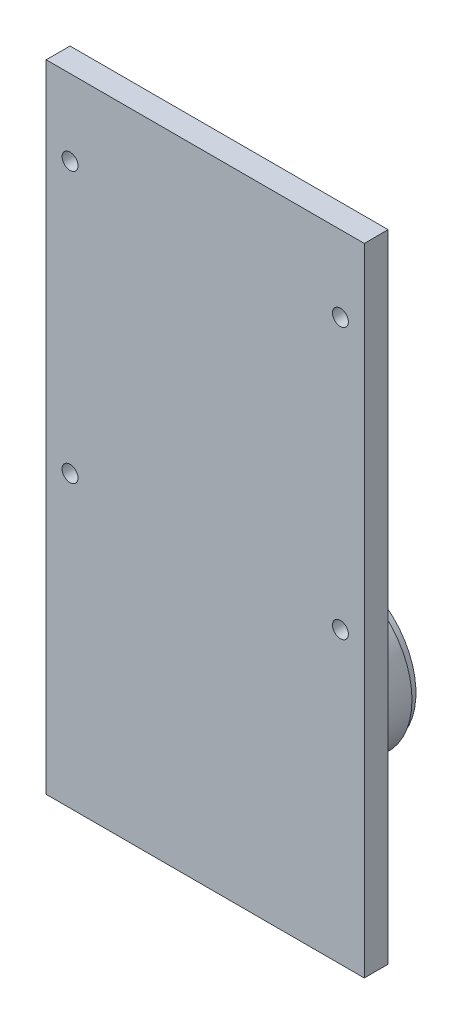
ISO-10303-21;
HEADER;
FILE_DESCRIPTION(('STEP AP214'),'2;1');
FILE_NAME('part.step','',(''),(''),'','','');
FILE_SCHEMA(('AUTOMOTIVE_DESIGN { 1 0 10303 214 1 1 1 1 }'));
ENDSEC;
DATA;
#1=APPLICATION_CONTEXT('core data for automotive mechanical design processes');
#2=APPLICATION_PROTOCOL_DEFINITION('international standard','automotive_design',2000,#1);
#3=PRODUCT_CONTEXT('',#1,'mechanical');
#4=PRODUCT('Part','Part','',(#3));
#5=PRODUCT_RELATED_PRODUCT_CATEGORY('part','',(#4));
#6=PRODUCT_DEFINITION_FORMATION('','',#4);
#7=PRODUCT_DEFINITION_CONTEXT('part definition',#1,'design');
#8=PRODUCT_DEFINITION('design','',#6,#7);
#9=PRODUCT_DEFINITION_SHAPE('','',#8);
#10=(LENGTH_UNIT() NAMED_UNIT(*) SI_UNIT(.MILLI.,.METRE.));
#11=(NAMED_UNIT(*) PLANE_ANGLE_UNIT() SI_UNIT($,.RADIAN.));
#12=(NAMED_UNIT(*) SI_UNIT($,.STERADIAN.) SOLID_ANGLE_UNIT());
#13=UNCERTAINTY_MEASURE_WITH_UNIT(LENGTH_MEASURE(1.E-05),#10,'distance_accuracy_value','');
#14=(GEOMETRIC_REPRESENTATION_CONTEXT(3) GLOBAL_UNCERTAINTY_ASSIGNED_CONTEXT((#13)) GLOBAL_UNIT_ASSIGNED_CONTEXT((#10,
#11,#12)) REPRESENTATION_CONTEXT('',''));
#15=CARTESIAN_POINT('',(0.,0.,0.));
#16=DIRECTION('',(0.,0.,1.));
#17=DIRECTION('',(1.,0.,0.));
#18=AXIS2_PLACEMENT_3D('',#15,#16,#17);
#19=CARTESIAN_POINT('',(20.,17.3034898736371,-13.));
#20=DIRECTION('',(0.,0.,-1.));
#21=DIRECTION('',(-1.,0.,0.));
#22=AXIS2_PLACEMENT_3D('',#19,#20,#21);
#23=PLANE('',#22);
#24=CARTESIAN_POINT('',(20.,17.3034898736371,-13.));
#25=DIRECTION('',(0.,0.,-1.));
#26=DIRECTION('',(-1.,0.,0.));
#27=AXIS2_PLACEMENT_3D('',#24,#25,#26);
#28=CIRCLE('',#27,7.5);
#29=CARTESIAN_POINT('',(12.5,17.3034898736371,-13.));
#30=VERTEX_POINT('',#29);
#31=EDGE_CURVE('E291',#30,#30,#28,.T.);
#32=ORIENTED_EDGE('',*,*,#31,.T.);
#33=EDGE_LOOP('',(#32));
#34=FACE_BOUND('',#33,.T.);
#35=CARTESIAN_POINT('',(20.,17.3034898736371,-13.));
#36=DIRECTION('',(0.,0.,-1.));
#37=DIRECTION('',(-1.,0.,0.));
#38=AXIS2_PLACEMENT_3D('',#35,#36,#37);
#39=CIRCLE('',#38,8.53357649545198);
#40=CARTESIAN_POINT('',(11.466423504548,17.3034898736371,-13.));
#41=VERTEX_POINT('',#40);
#42=EDGE_CURVE('E49',#41,#41,#39,.F.);
#43=ORIENTED_EDGE('',*,*,#42,.T.);
#44=EDGE_LOOP('',(#43));
#45=FACE_BOUND('',#44,.T.);
#46=ADVANCED_FACE('F45',(#34,#45),#23,.F.);
#47=CARTESIAN_POINT('',(20.,17.3034898736371,-13.));
#48=DIRECTION('',(0.,1.,0.));
#49=DIRECTION('',(-1.,0.,0.));
#50=AXIS2_PLACEMENT_3D('',#47,#48,#49);
#51=SPHERICAL_SURFACE('',#50,8.53357649545198);
#52=CARTESIAN_POINT('',(20.,17.3034898736371,-13.));
#53=DIRECTION('',(0.,0.,-1.));
#54=DIRECTION('',(-1.,0.,0.));
#55=AXIS2_PLACEMENT_3D('',#52,#53,#54);
#56=SPHERICAL_SURFACE('',#55,8.53357649545198);
#57=ORIENTED_EDGE('',*,*,#42,.F.);
#58=EDGE_LOOP('',(#57));
#59=FACE_BOUND('',#58,.T.);
#60=ADVANCED_FACE('F220',(#59),#56,.F.);
#61=CARTESIAN_POINT('',(20.,17.3034898736371,-13.));
#62=DIRECTION('',(0.,0.,-1.));
#63=DIRECTION('',(-1.,0.,0.));
#64=AXIS2_PLACEMENT_3D('',#61,#62,#63);
#65=CYLINDRICAL_SURFACE('',#64,7.5);
#66=ORIENTED_EDGE('',*,*,#31,.F.);
#67=EDGE_LOOP('',(#66));
#68=FACE_BOUND('',#67,.T.);
#69=CARTESIAN_POINT('',(20.,17.3034898736371,-14.));
#70=DIRECTION('',(0.,0.,-1.));
#71=DIRECTION('',(-1.,0.,0.));
#72=AXIS2_PLACEMENT_3D('',#69,#70,#71);
#73=CIRCLE('',#72,7.5);
#74=CARTESIAN_POINT('',(12.5,17.3034898736371,-14.));
#75=VERTEX_POINT('',#74);
#76=EDGE_CURVE('E294',#75,#75,#73,.T.);
#77=ORIENTED_EDGE('',*,*,#76,.T.);
#78=EDGE_LOOP('',(#77));
#79=FACE_BOUND('',#78,.T.);
#80=ADVANCED_FACE('F226',(#68,#79),#65,.F.);
#81=CARTESIAN_POINT('',(0.,0.,3.));
#82=DIRECTION('',(1.,0.,0.));
#83=DIRECTION('',(0.,0.,-1.));
#84=AXIS2_PLACEMENT_3D('',#81,#82,#83);
#85=PLANE('',#84);
#86=DIRECTION('',(0.,-1.,0.));
#87=VECTOR('',#86,1.);
#88=CARTESIAN_POINT('',(0.,0.,0.));
#89=LINE('',#88,#87);
#90=CARTESIAN_POINT('',(0.,80.,0.));
#91=VERTEX_POINT('',#90);
#92=CARTESIAN_POINT('',(0.,0.,0.));
#93=VERTEX_POINT('',#92);
#94=EDGE_CURVE('E120',#91,#93,#89,.T.);
#95=ORIENTED_EDGE('',*,*,#94,.T.);
#96=DIRECTION('',(0.,0.,-1.));
#97=VECTOR('',#96,1.);
#98=CARTESIAN_POINT('',(0.,0.,3.));
#99=LINE('',#98,#97);
#100=CARTESIAN_POINT('',(0.,0.,3.));
#101=VERTEX_POINT('',#100);
#102=EDGE_CURVE('E109',#101,#93,#99,.T.);
#103=ORIENTED_EDGE('',*,*,#102,.F.);
#104=DIRECTION('',(0.,-1.,0.));
#105=VECTOR('',#104,1.);
#106=CARTESIAN_POINT('',(0.,0.,3.));
#107=LINE('',#106,#105);
#108=CARTESIAN_POINT('',(0.,80.,3.));
#109=VERTEX_POINT('',#108);
#110=EDGE_CURVE('E101',#109,#101,#107,.T.);
#111=ORIENTED_EDGE('',*,*,#110,.F.);
#112=DIRECTION('',(0.,0.,-1.));
#113=VECTOR('',#112,1.);
#114=CARTESIAN_POINT('',(0.,80.,3.));
#115=LINE('',#114,#113);
#116=EDGE_CURVE('E116',#109,#91,#115,.T.);
#117=ORIENTED_EDGE('',*,*,#116,.T.);
#118=EDGE_LOOP('',(#95,#103,#111,#117));
#119=FACE_BOUND('',#118,.T.);
#120=ADVANCED_FACE('F279',(#119),#85,.F.);
#121=CARTESIAN_POINT('',(0.,0.,3.));
#122=DIRECTION('',(0.,1.,0.));
#123=DIRECTION('',(0.,0.,1.));
#124=AXIS2_PLACEMENT_3D('',#121,#122,#123);
#125=PLANE('',#124);
#126=DIRECTION('',(1.,0.,0.));
#127=VECTOR('',#126,1.);
#128=CARTESIAN_POINT('',(0.,0.,0.));
#129=LINE('',#128,#127);
#130=CARTESIAN_POINT('',(40.,0.,0.));
#131=VERTEX_POINT('',#130);
#132=EDGE_CURVE('E107',#93,#131,#129,.T.);
#133=ORIENTED_EDGE('',*,*,#132,.T.);
#134=DIRECTION('',(0.,0.,-1.));
#135=VECTOR('',#134,1.);
#136=CARTESIAN_POINT('',(40.,0.,3.));
#137=LINE('',#136,#135);
#138=CARTESIAN_POINT('',(40.,0.,3.));
#139=VERTEX_POINT('',#138);
#140=EDGE_CURVE('E105',#139,#131,#137,.T.);
#141=ORIENTED_EDGE('',*,*,#140,.F.);
#142=DIRECTION('',(1.,0.,0.));
#143=VECTOR('',#142,1.);
#144=CARTESIAN_POINT('',(0.,0.,3.));
#145=LINE('',#144,#143);
#146=EDGE_CURVE('E96',#101,#139,#145,.T.);
#147=ORIENTED_EDGE('',*,*,#146,.F.);
#148=ORIENTED_EDGE('',*,*,#102,.T.);
#149=EDGE_LOOP('',(#133,#141,#147,#148));
#150=FACE_BOUND('',#149,.T.);
#151=ADVANCED_FACE('F106',(#150),#125,.F.);
#152=CARTESIAN_POINT('',(40.,0.,3.));
#153=DIRECTION('',(-1.,0.,0.));
#154=DIRECTION('',(0.,0.,1.));
#155=AXIS2_PLACEMENT_3D('',#152,#153,#154);
#156=PLANE('',#155);
#157=DIRECTION('',(0.,1.,0.));
#158=VECTOR('',#157,1.);
#159=CARTESIAN_POINT('',(40.,0.,0.));
#160=LINE('',#159,#158);
#161=CARTESIAN_POINT('',(40.,80.,0.));
#162=VERTEX_POINT('',#161);
#163=EDGE_CURVE('E82',#131,#162,#160,.T.);
#164=ORIENTED_EDGE('',*,*,#163,.T.);
#165=DIRECTION('',(0.,0.,-1.));
#166=VECTOR('',#165,1.);
#167=CARTESIAN_POINT('',(40.,80.,3.));
#168=LINE('',#167,#166);
#169=CARTESIAN_POINT('',(40.,80.,3.));
#170=VERTEX_POINT('',#169);
#171=EDGE_CURVE('E110',#170,#162,#168,.T.);
#172=ORIENTED_EDGE('',*,*,#171,.F.);
#173=DIRECTION('',(0.,1.,0.));
#174=VECTOR('',#173,1.);
#175=CARTESIAN_POINT('',(40.,0.,3.));
#176=LINE('',#175,#174);
#177=EDGE_CURVE('E99',#139,#170,#176,.T.);
#178=ORIENTED_EDGE('',*,*,#177,.F.);
#179=ORIENTED_EDGE('',*,*,#140,.T.);
#180=EDGE_LOOP('',(#164,#172,#178,#179));
#181=FACE_BOUND('',#180,.T.);
#182=ADVANCED_FACE('F112',(#181),#156,.F.);
#183=CARTESIAN_POINT('',(0.,80.,3.));
#184=DIRECTION('',(0.,-1.,0.));
#185=DIRECTION('',(0.,0.,-1.));
#186=AXIS2_PLACEMENT_3D('',#183,#184,#185);
#187=PLANE('',#186);
#188=DIRECTION('',(-1.,0.,0.));
#189=VECTOR('',#188,1.);
#190=CARTESIAN_POINT('',(0.,80.,0.));
#191=LINE('',#190,#189);
#192=EDGE_CURVE('E88',#162,#91,#191,.T.);
#193=ORIENTED_EDGE('',*,*,#192,.T.);
#194=ORIENTED_EDGE('',*,*,#116,.F.);
#195=DIRECTION('',(-1.,0.,0.));
#196=VECTOR('',#195,1.);
#197=CARTESIAN_POINT('',(0.,80.,3.));
#198=LINE('',#197,#196);
#199=EDGE_CURVE('E65',#170,#109,#198,.T.);
#200=ORIENTED_EDGE('',*,*,#199,.F.);
#201=ORIENTED_EDGE('',*,*,#171,.T.);
#202=EDGE_LOOP('',(#193,#194,#200,#201));
#203=FACE_BOUND('',#202,.T.);
#204=ADVANCED_FACE('F265',(#203),#187,.F.);
#205=CARTESIAN_POINT('',(0.,0.,3.));
#206=DIRECTION('',(0.,0.,-1.));
#207=DIRECTION('',(-1.,0.,0.));
#208=AXIS2_PLACEMENT_3D('',#205,#206,#207);
#209=PLANE('',#208);
#210=CARTESIAN_POINT('',(3.,36.4461491386061,3.));
#211=DIRECTION('',(0.,0.,1.));
#212=DIRECTION('',(1.,0.,0.));
#213=AXIS2_PLACEMENT_3D('',#210,#211,#212);
#214=CIRCLE('',#213,1.);
#215=CARTESIAN_POINT('',(4.,36.4461491386061,3.));
#216=VERTEX_POINT('',#215);
#217=EDGE_CURVE('E178',#216,#216,#214,.T.);
#218=ORIENTED_EDGE('',*,*,#217,.F.);
#219=EDGE_LOOP('',(#218));
#220=FACE_BOUND('',#219,.T.);
#221=CARTESIAN_POINT('',(37.,70.4461491386061,3.));
#222=DIRECTION('',(0.,0.,1.));
#223=DIRECTION('',(1.,0.,0.));
#224=AXIS2_PLACEMENT_3D('',#221,#222,#223);
#225=CIRCLE('',#224,0.999999999999998);
#226=CARTESIAN_POINT('',(38.,70.4461491386061,3.));
#227=VERTEX_POINT('',#226);
#228=EDGE_CURVE('E177',#227,#227,#225,.T.);
#229=ORIENTED_EDGE('',*,*,#228,.F.);
#230=EDGE_LOOP('',(#229));
#231=FACE_BOUND('',#230,.T.);
#232=CARTESIAN_POINT('',(37.,36.4461491386061,3.));
#233=DIRECTION('',(0.,0.,1.));
#234=DIRECTION('',(1.,0.,0.));
#235=AXIS2_PLACEMENT_3D('',#232,#233,#234);
#236=CIRCLE('',#235,0.999999999999998);
#237=CARTESIAN_POINT('',(38.,36.4461491386061,3.));
#238=VERTEX_POINT('',#237);
#239=EDGE_CURVE('E163',#238,#238,#236,.T.);
#240=ORIENTED_EDGE('',*,*,#239,.F.);
#241=EDGE_LOOP('',(#240));
#242=FACE_BOUND('',#241,.T.);
#243=CARTESIAN_POINT('',(3.,70.4461491386061,3.));
#244=DIRECTION('',(0.,0.,1.));
#245=DIRECTION('',(1.,0.,0.));
#246=AXIS2_PLACEMENT_3D('',#243,#244,#245);
#247=CIRCLE('',#246,1.);
#248=CARTESIAN_POINT('',(4.,70.4461491386061,3.));
#249=VERTEX_POINT('',#248);
#250=EDGE_CURVE('E187',#249,#249,#247,.T.);
#251=ORIENTED_EDGE('',*,*,#250,.F.);
#252=EDGE_LOOP('',(#251));
#253=FACE_BOUND('',#252,.T.);
#254=ORIENTED_EDGE('',*,*,#110,.T.);
#255=ORIENTED_EDGE('',*,*,#146,.T.);
#256=ORIENTED_EDGE('',*,*,#177,.T.);
#257=ORIENTED_EDGE('',*,*,#199,.T.);
#258=EDGE_LOOP('',(#254,#255,#256,#257));
#259=FACE_BOUND('',#258,.T.);
#260=ADVANCED_FACE('F97',(#220,#231,#242,#253,#259),#209,.F.);
#261=CARTESIAN_POINT('',(0.,0.,0.));
#262=DIRECTION('',(0.,0.,-1.));
#263=DIRECTION('',(-1.,0.,0.));
#264=AXIS2_PLACEMENT_3D('',#261,#262,#263);
#265=PLANE('',#264);
#266=CARTESIAN_POINT('',(20.,17.3034898736371,0.));
#267=DIRECTION('',(0.,0.,-1.));
#268=DIRECTION('',(-1.,0.,0.));
#269=AXIS2_PLACEMENT_3D('',#266,#267,#268);
#270=CIRCLE('',#269,16.2);
#271=CARTESIAN_POINT('',(3.8,17.3034898736371,0.));
#272=VERTEX_POINT('',#271);
#273=EDGE_CURVE('E56',#272,#272,#270,.F.);
#274=ORIENTED_EDGE('',*,*,#273,.T.);
#275=EDGE_LOOP('',(#274));
#276=FACE_BOUND('',#275,.T.);
#277=CARTESIAN_POINT('',(3.,36.4461491386061,0.));
#278=DIRECTION('',(0.,0.,-1.));
#279=DIRECTION('',(-1.,0.,0.));
#280=AXIS2_PLACEMENT_3D('',#277,#278,#279);
#281=CIRCLE('',#280,1.);
#282=CARTESIAN_POINT('',(2.,36.4461491386061,0.));
#283=VERTEX_POINT('',#282);
#284=EDGE_CURVE('E182',#283,#283,#281,.F.);
#285=ORIENTED_EDGE('',*,*,#284,.T.);
#286=EDGE_LOOP('',(#285));
#287=FACE_BOUND('',#286,.T.);
#288=CARTESIAN_POINT('',(37.,70.4461491386061,0.));
#289=DIRECTION('',(0.,0.,-1.));
#290=DIRECTION('',(-1.,0.,0.));
#291=AXIS2_PLACEMENT_3D('',#288,#289,#290);
#292=CIRCLE('',#291,0.999999999999998);
#293=CARTESIAN_POINT('',(36.,70.4461491386061,0.));
#294=VERTEX_POINT('',#293);
#295=EDGE_CURVE('E183',#294,#294,#292,.F.);
#296=ORIENTED_EDGE('',*,*,#295,.T.);
#297=EDGE_LOOP('',(#296));
#298=FACE_BOUND('',#297,.T.);
#299=CARTESIAN_POINT('',(37.,36.4461491386061,0.));
#300=DIRECTION('',(0.,0.,-1.));
#301=DIRECTION('',(-1.,0.,0.));
#302=AXIS2_PLACEMENT_3D('',#299,#300,#301);
#303=CIRCLE('',#302,0.999999999999998);
#304=CARTESIAN_POINT('',(36.,36.4461491386061,0.));
#305=VERTEX_POINT('',#304);
#306=EDGE_CURVE('E169',#305,#305,#303,.F.);
#307=ORIENTED_EDGE('',*,*,#306,.T.);
#308=EDGE_LOOP('',(#307));
#309=FACE_BOUND('',#308,.T.);
#310=CARTESIAN_POINT('',(3.,70.4461491386061,0.));
#311=DIRECTION('',(0.,0.,-1.));
#312=DIRECTION('',(-1.,0.,0.));
#313=AXIS2_PLACEMENT_3D('',#310,#311,#312);
#314=CIRCLE('',#313,1.);
#315=CARTESIAN_POINT('',(2.,70.4461491386061,0.));
#316=VERTEX_POINT('',#315);
#317=EDGE_CURVE('E124',#316,#316,#314,.F.);
#318=ORIENTED_EDGE('',*,*,#317,.T.);
#319=EDGE_LOOP('',(#318));
#320=FACE_BOUND('',#319,.T.);
#321=ORIENTED_EDGE('',*,*,#94,.F.);
#322=ORIENTED_EDGE('',*,*,#192,.F.);
#323=ORIENTED_EDGE('',*,*,#163,.F.);
#324=ORIENTED_EDGE('',*,*,#132,.F.);
#325=EDGE_LOOP('',(#321,#322,#323,#324));
#326=FACE_BOUND('',#325,.T.);
#327=ADVANCED_FACE('F144',(#276,#287,#298,#309,#320,#326),#265,.T.);
#328=CARTESIAN_POINT('',(3.,70.4461491386061,-2.82842712474619));
#329=DIRECTION('',(0.,0.,1.));
#330=DIRECTION('',(1.,0.,0.));
#331=AXIS2_PLACEMENT_3D('',#328,#329,#330);
#332=CYLINDRICAL_SURFACE('',#331,1.);
#333=ORIENTED_EDGE('',*,*,#250,.T.);
#334=EDGE_LOOP('',(#333));
#335=FACE_BOUND('',#334,.T.);
#336=ORIENTED_EDGE('',*,*,#317,.F.);
#337=EDGE_LOOP('',(#336));
#338=FACE_BOUND('',#337,.T.);
#339=ADVANCED_FACE('F204',(#335,#338),#332,.F.);
#340=CARTESIAN_POINT('',(37.,36.4461491386061,-2.82842712474619));
#341=DIRECTION('',(0.,0.,1.));
#342=DIRECTION('',(1.,0.,0.));
#343=AXIS2_PLACEMENT_3D('',#340,#341,#342);
#344=CYLINDRICAL_SURFACE('',#343,0.999999999999998);
#345=ORIENTED_EDGE('',*,*,#239,.T.);
#346=EDGE_LOOP('',(#345));
#347=FACE_BOUND('',#346,.T.);
#348=ORIENTED_EDGE('',*,*,#306,.F.);
#349=EDGE_LOOP('',(#348));
#350=FACE_BOUND('',#349,.T.);
#351=ADVANCED_FACE('F206',(#347,#350),#344,.F.);
#352=CARTESIAN_POINT('',(37.,70.4461491386061,-2.82842712474619));
#353=DIRECTION('',(0.,0.,1.));
#354=DIRECTION('',(1.,0.,0.));
#355=AXIS2_PLACEMENT_3D('',#352,#353,#354);
#356=CYLINDRICAL_SURFACE('',#355,0.999999999999998);
#357=ORIENTED_EDGE('',*,*,#228,.T.);
#358=EDGE_LOOP('',(#357));
#359=FACE_BOUND('',#358,.T.);
#360=ORIENTED_EDGE('',*,*,#295,.F.);
#361=EDGE_LOOP('',(#360));
#362=FACE_BOUND('',#361,.T.);
#363=ADVANCED_FACE('F213',(#359,#362),#356,.F.);
#364=CARTESIAN_POINT('',(3.,36.4461491386061,-2.82842712474619));
#365=DIRECTION('',(0.,0.,1.));
#366=DIRECTION('',(1.,0.,0.));
#367=AXIS2_PLACEMENT_3D('',#364,#365,#366);
#368=CYLINDRICAL_SURFACE('',#367,1.);
#369=ORIENTED_EDGE('',*,*,#217,.T.);
#370=EDGE_LOOP('',(#369));
#371=FACE_BOUND('',#370,.T.);
#372=ORIENTED_EDGE('',*,*,#284,.F.);
#373=EDGE_LOOP('',(#372));
#374=FACE_BOUND('',#373,.T.);
#375=ADVANCED_FACE('F156',(#371,#374),#368,.F.);
#376=CARTESIAN_POINT('',(20.,17.3034898736371,-3.));
#377=DIRECTION('',(0.,0.,1.));
#378=DIRECTION('',(1.,0.,0.));
#379=AXIS2_PLACEMENT_3D('',#376,#377,#378);
#380=CYLINDRICAL_SURFACE('',#379,15.);
#381=CARTESIAN_POINT('',(20.,17.3034898736371,-1.2));
#382=DIRECTION('',(0.,0.,-1.));
#383=DIRECTION('',(-1.,0.,0.));
#384=AXIS2_PLACEMENT_3D('',#381,#382,#383);
#385=CIRCLE('',#384,15.);
#386=CARTESIAN_POINT('',(5.,17.3034898736371,-1.2));
#387=VERTEX_POINT('',#386);
#388=EDGE_CURVE('E137',#387,#387,#385,.T.);
#389=ORIENTED_EDGE('',*,*,#388,.T.);
#390=EDGE_LOOP('',(#389));
#391=FACE_BOUND('',#390,.T.);
#392=CARTESIAN_POINT('',(20.,17.3034898736371,-3.));
#393=DIRECTION('',(0.,0.,-1.));
#394=DIRECTION('',(-1.,0.,0.));
#395=AXIS2_PLACEMENT_3D('',#392,#393,#394);
#396=CIRCLE('',#395,15.);
#397=CARTESIAN_POINT('',(5.,17.3034898736371,-3.));
#398=VERTEX_POINT('',#397);
#399=EDGE_CURVE('E160',#398,#398,#396,.T.);
#400=ORIENTED_EDGE('',*,*,#399,.F.);
#401=EDGE_LOOP('',(#400));
#402=FACE_BOUND('',#401,.T.);
#403=ADVANCED_FACE('F153',(#391,#402),#380,.T.);
#404=CARTESIAN_POINT('',(20.,17.3034898736371,-3.));
#405=DIRECTION('',(0.,0.,-1.));
#406=DIRECTION('',(-1.,0.,0.));
#407=AXIS2_PLACEMENT_3D('',#404,#405,#406);
#408=PLANE('',#407);
#409=CARTESIAN_POINT('',(20.,17.3034898736371,-3.));
#410=DIRECTION('',(0.,0.,-1.));
#411=DIRECTION('',(-1.,0.,0.));
#412=AXIS2_PLACEMENT_3D('',#409,#410,#411);
#413=CIRCLE('',#412,10.);
#414=CARTESIAN_POINT('',(10.,17.3034898736371,-3.));
#415=VERTEX_POINT('',#414);
#416=EDGE_CURVE('E11',#415,#415,#413,.T.);
#417=ORIENTED_EDGE('',*,*,#416,.F.);
#418=EDGE_LOOP('',(#417));
#419=FACE_BOUND('',#418,.T.);
#420=ORIENTED_EDGE('',*,*,#399,.T.);
#421=EDGE_LOOP('',(#420));
#422=FACE_BOUND('',#421,.T.);
#423=ADVANCED_FACE('F150',(#419,#422),#408,.T.);
#424=CARTESIAN_POINT('',(20.,17.3034898736371,-1.2));
#425=DIRECTION('',(0.,0.,-1.));
#426=DIRECTION('',(-1.,0.,0.));
#427=AXIS2_PLACEMENT_3D('',#424,#425,#426);
#428=TOROIDAL_SURFACE('',#427,16.2,1.2);
#429=ORIENTED_EDGE('',*,*,#273,.F.);
#430=EDGE_LOOP('',(#429));
#431=FACE_BOUND('',#430,.T.);
#432=ORIENTED_EDGE('',*,*,#388,.F.);
#433=EDGE_LOOP('',(#432));
#434=FACE_BOUND('',#433,.T.);
#435=ADVANCED_FACE('F47',(#431,#434),#428,.F.);
#436=CARTESIAN_POINT('',(20.,17.3034898736371,-13.));
#437=DIRECTION('',(0.,0.,1.));
#438=DIRECTION('',(1.,0.,0.));
#439=AXIS2_PLACEMENT_3D('',#436,#437,#438);
#440=CYLINDRICAL_SURFACE('',#439,10.);
#441=CARTESIAN_POINT('',(20.,17.3034898736371,-13.));
#442=DIRECTION('',(0.,0.,-1.));
#443=DIRECTION('',(-1.,0.,0.));
#444=AXIS2_PLACEMENT_3D('',#441,#442,#443);
#445=CIRCLE('',#444,10.);
#446=CARTESIAN_POINT('',(10.,17.3034898736371,-13.));
#447=VERTEX_POINT('',#446);
#448=EDGE_CURVE('E164',#447,#447,#445,.T.);
#449=ORIENTED_EDGE('',*,*,#448,.F.);
#450=EDGE_LOOP('',(#449));
#451=FACE_BOUND('',#450,.T.);
#452=ORIENTED_EDGE('',*,*,#416,.T.);
#453=EDGE_LOOP('',(#452));
#454=FACE_BOUND('',#453,.T.);
#455=ADVANCED_FACE('F149',(#451,#454),#440,.T.);
#456=CARTESIAN_POINT('',(20.,17.3034898736371,-13.));
#457=DIRECTION('',(0.,0.,-1.));
#458=DIRECTION('',(-1.,0.,0.));
#459=AXIS2_PLACEMENT_3D('',#456,#457,#458);
#460=PLANE('',#459);
#461=CARTESIAN_POINT('',(20.,17.3034898736371,-13.));
#462=DIRECTION('',(0.,0.,-1.));
#463=DIRECTION('',(-1.,0.,0.));
#464=AXIS2_PLACEMENT_3D('',#461,#462,#463);
#465=CIRCLE('',#464,9.5);
#466=CARTESIAN_POINT('',(10.5,17.3034898736371,-13.));
#467=VERTEX_POINT('',#466);
#468=EDGE_CURVE('E299',#467,#467,#465,.T.);
#469=ORIENTED_EDGE('',*,*,#468,.F.);
#470=EDGE_LOOP('',(#469));
#471=FACE_BOUND('',#470,.T.);
#472=ORIENTED_EDGE('',*,*,#448,.T.);
#473=EDGE_LOOP('',(#472));
#474=FACE_BOUND('',#473,.T.);
#475=ADVANCED_FACE('F237',(#471,#474),#460,.T.);
#476=CARTESIAN_POINT('',(20.,17.3034898736371,-14.));
#477=DIRECTION('',(0.,0.,1.));
#478=DIRECTION('',(1.,0.,0.));
#479=AXIS2_PLACEMENT_3D('',#476,#477,#478);
#480=CYLINDRICAL_SURFACE('',#479,9.5);
#481=CARTESIAN_POINT('',(20.,17.3034898736371,-14.));
#482=DIRECTION('',(0.,0.,-1.));
#483=DIRECTION('',(-1.,0.,0.));
#484=AXIS2_PLACEMENT_3D('',#481,#482,#483);
#485=CIRCLE('',#484,9.5);
#486=CARTESIAN_POINT('',(10.5,17.3034898736371,-14.));
#487=VERTEX_POINT('',#486);
#488=EDGE_CURVE('E302',#487,#487,#485,.T.);
#489=ORIENTED_EDGE('',*,*,#488,.F.);
#490=EDGE_LOOP('',(#489));
#491=FACE_BOUND('',#490,.T.);
#492=ORIENTED_EDGE('',*,*,#468,.T.);
#493=EDGE_LOOP('',(#492));
#494=FACE_BOUND('',#493,.T.);
#495=ADVANCED_FACE('F235',(#491,#494),#480,.T.);
#496=CARTESIAN_POINT('',(20.,17.3034898736371,-14.));
#497=DIRECTION('',(0.,0.,-1.));
#498=DIRECTION('',(-1.,0.,0.));
#499=AXIS2_PLACEMENT_3D('',#496,#497,#498);
#500=PLANE('',#499);
#501=ORIENTED_EDGE('',*,*,#76,.F.);
#502=EDGE_LOOP('',(#501));
#503=FACE_BOUND('',#502,.T.);
#504=ORIENTED_EDGE('',*,*,#488,.T.);
#505=EDGE_LOOP('',(#504));
#506=FACE_BOUND('',#505,.T.);
#507=ADVANCED_FACE('F233',(#503,#506),#500,.T.);
#508=CLOSED_SHELL('',(#46,#60,#80,#120,#151,#182,#204,#260,#327,#339,#351,#363,#375,#403,#423,
#435,#455,#475,#495,#507));
#509=MANIFOLD_SOLID_BREP('B2',#508);
#510=ADVANCED_BREP_SHAPE_REPRESENTATION('',(#18,#509),#14);
#511=SHAPE_DEFINITION_REPRESENTATION(#9,#510);
ENDSEC;
END-ISO-10303-21;
